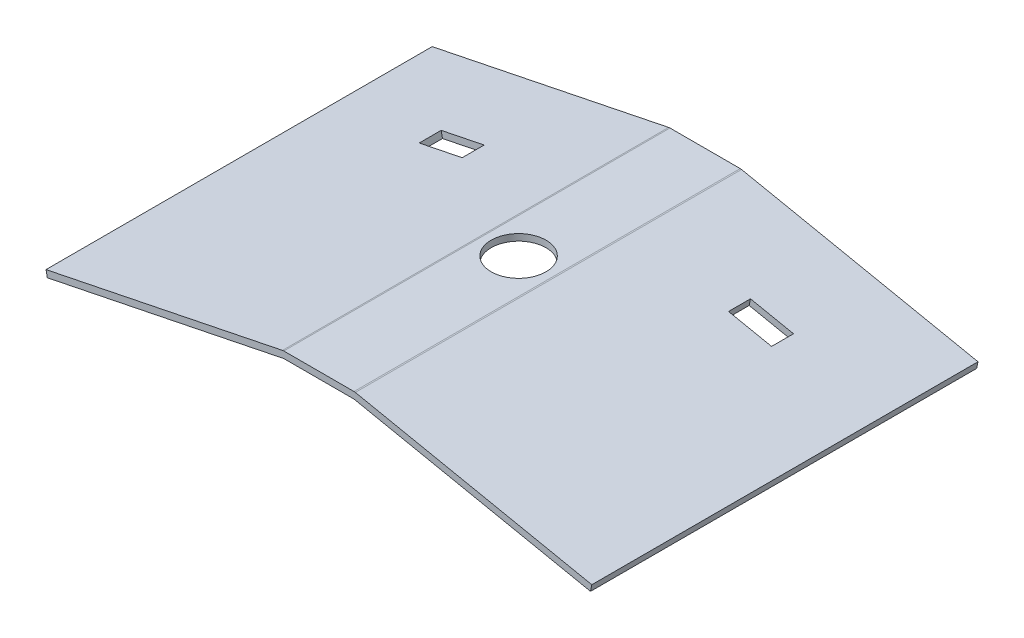
ISO-10303-21;
HEADER;
FILE_DESCRIPTION(('STEP AP214'),'2;1');
FILE_NAME('part.step','',(''),(''),'','','');
FILE_SCHEMA(('AUTOMOTIVE_DESIGN { 1 0 10303 214 1 1 1 1 }'));
ENDSEC;
DATA;
#1=APPLICATION_CONTEXT('core data for automotive mechanical design processes');
#2=APPLICATION_PROTOCOL_DEFINITION('international standard','automotive_design',2000,#1);
#3=PRODUCT_CONTEXT('',#1,'mechanical');
#4=PRODUCT('Part','Part','',(#3));
#5=PRODUCT_RELATED_PRODUCT_CATEGORY('part','',(#4));
#6=PRODUCT_DEFINITION_FORMATION('','',#4);
#7=PRODUCT_DEFINITION_CONTEXT('part definition',#1,'design');
#8=PRODUCT_DEFINITION('design','',#6,#7);
#9=PRODUCT_DEFINITION_SHAPE('','',#8);
#10=(LENGTH_UNIT() NAMED_UNIT(*) SI_UNIT(.MILLI.,.METRE.));
#11=(NAMED_UNIT(*) PLANE_ANGLE_UNIT() SI_UNIT($,.RADIAN.));
#12=(NAMED_UNIT(*) SI_UNIT($,.STERADIAN.) SOLID_ANGLE_UNIT());
#13=UNCERTAINTY_MEASURE_WITH_UNIT(LENGTH_MEASURE(1.E-05),#10,'distance_accuracy_value','');
#14=(GEOMETRIC_REPRESENTATION_CONTEXT(3) GLOBAL_UNCERTAINTY_ASSIGNED_CONTEXT((#13)) GLOBAL_UNIT_ASSIGNED_CONTEXT((#10,
#11,#12)) REPRESENTATION_CONTEXT('',''));
#15=CARTESIAN_POINT('',(0.,0.,0.));
#16=DIRECTION('',(0.,0.,1.));
#17=DIRECTION('',(1.,0.,0.));
#18=AXIS2_PLACEMENT_3D('',#15,#16,#17);
#19=CARTESIAN_POINT('',(4.55909920019514,22.335152700819,-85.));
#20=DIRECTION('',(0.199998115287844,0.979796281826641,0.));
#21=DIRECTION('',(-0.979796281826641,0.199998115287844,0.));
#22=AXIS2_PLACEMENT_3D('',#19,#20,#21);
#23=PLANE('',#22);
#24=DIRECTION('',(0.979796281826641,-0.199998115287844,0.));
#25=VECTOR('',#24,1.);
#26=CARTESIAN_POINT('',(4.55909920019514,22.335152700819,-35.));
#27=LINE('',#26,#25);
#28=CARTESIAN_POINT('',(60.0908326821988,10.9998963408314,-35.));
#29=VERTEX_POINT('',#28);
#30=CARTESIAN_POINT('',(79.6867583187317,6.99993403507454,-35.));
#31=VERTEX_POINT('',#30);
#32=EDGE_CURVE('E197',#29,#31,#27,.T.);
#33=ORIENTED_EDGE('',*,*,#32,.T.);
#34=DIRECTION('',(0.,0.,-1.));
#35=VECTOR('',#34,1.);
#36=CARTESIAN_POINT('',(79.6867583187317,6.99993403507455,-85.));
#37=LINE('',#36,#35);
#38=CARTESIAN_POINT('',(79.6867583187317,6.99993403507454,-45.));
#39=VERTEX_POINT('',#38);
#40=EDGE_CURVE('E200',#31,#39,#37,.T.);
#41=ORIENTED_EDGE('',*,*,#40,.T.);
#42=DIRECTION('',(-0.979796281826641,0.199998115287844,0.));
#43=VECTOR('',#42,1.);
#44=CARTESIAN_POINT('',(4.55909920019514,22.335152700819,-45.));
#45=LINE('',#44,#43);
#46=CARTESIAN_POINT('',(60.0908326821988,10.9998963408314,-45.));
#47=VERTEX_POINT('',#46);
#48=EDGE_CURVE('E192',#39,#47,#45,.T.);
#49=ORIENTED_EDGE('',*,*,#48,.T.);
#50=DIRECTION('',(0.,0.,1.));
#51=VECTOR('',#50,1.);
#52=CARTESIAN_POINT('',(60.0908326821988,10.9998963408314,-85.));
#53=LINE('',#52,#51);
#54=EDGE_CURVE('E172',#47,#29,#53,.T.);
#55=ORIENTED_EDGE('',*,*,#54,.T.);
#56=EDGE_LOOP('',(#33,#41,#49,#55));
#57=FACE_BOUND('',#56,.T.);
#58=DIRECTION('',(0.,0.,1.));
#59=VECTOR('',#58,1.);
#60=CARTESIAN_POINT('',(16.,19.9998115287844,-85.));
#61=LINE('',#60,#59);
#62=CARTESIAN_POINT('',(16.,19.9998115287844,-85.));
#63=VERTEX_POINT('',#62);
#64=CARTESIAN_POINT('',(16.,19.9998115287844,91.));
#65=VERTEX_POINT('',#64);
#66=EDGE_CURVE('E298',#63,#65,#61,.T.);
#67=ORIENTED_EDGE('',*,*,#66,.F.);
#68=DIRECTION('',(-0.979796281826641,0.199998115287844,0.));
#69=VECTOR('',#68,1.);
#70=CARTESIAN_POINT('',(4.55909920019514,22.335152700819,-85.));
#71=LINE('',#70,#69);
#72=CARTESIAN_POINT('',(123.77759100093,-1.99998115287843,-85.));
#73=VERTEX_POINT('',#72);
#74=EDGE_CURVE('E286',#73,#63,#71,.T.);
#75=ORIENTED_EDGE('',*,*,#74,.F.);
#76=DIRECTION('',(0.,0.,1.));
#77=VECTOR('',#76,1.);
#78=CARTESIAN_POINT('',(123.77759100093,-1.99998115287843,-85.));
#79=LINE('',#78,#77);
#80=CARTESIAN_POINT('',(123.77759100093,-1.99998115287843,91.));
#81=VERTEX_POINT('',#80);
#82=EDGE_CURVE('E296',#73,#81,#79,.T.);
#83=ORIENTED_EDGE('',*,*,#82,.T.);
#84=DIRECTION('',(-0.979796281826641,0.199998115287844,0.));
#85=VECTOR('',#84,1.);
#86=CARTESIAN_POINT('',(4.55909920019514,22.335152700819,91.));
#87=LINE('',#86,#85);
#88=EDGE_CURVE('E262',#81,#65,#87,.T.);
#89=ORIENTED_EDGE('',*,*,#88,.T.);
#90=EDGE_LOOP('',(#67,#75,#83,#89));
#91=FACE_BOUND('',#90,.T.);
#92=ADVANCED_FACE('F40',(#57,#91),#23,.F.);
#93=CARTESIAN_POINT('',(0.,19.9998115287844,-85.));
#94=DIRECTION('',(0.,1.,0.));
#95=DIRECTION('',(-1.,0.,0.));
#96=AXIS2_PLACEMENT_3D('',#93,#94,#95);
#97=PLANE('',#96);
#98=CARTESIAN_POINT('',(0.,19.9998115287844,0.));
#99=DIRECTION('',(0.,1.,0.));
#100=DIRECTION('',(-1.,0.,0.));
#101=AXIS2_PLACEMENT_3D('',#98,#99,#100);
#102=CIRCLE('',#101,12.5);
#103=CARTESIAN_POINT('',(-12.5,19.9998115287844,0.));
#104=VERTEX_POINT('',#103);
#105=EDGE_CURVE('E238',#104,#104,#102,.T.);
#106=ORIENTED_EDGE('',*,*,#105,.T.);
#107=EDGE_LOOP('',(#106));
#108=FACE_BOUND('',#107,.T.);
#109=DIRECTION('',(0.,0.,1.));
#110=VECTOR('',#109,1.);
#111=CARTESIAN_POINT('',(-16.,19.9998115287844,-85.));
#112=LINE('',#111,#110);
#113=CARTESIAN_POINT('',(-16.,19.9998115287844,-85.));
#114=VERTEX_POINT('',#113);
#115=CARTESIAN_POINT('',(-16.,19.9998115287844,91.));
#116=VERTEX_POINT('',#115);
#117=EDGE_CURVE('E300',#114,#116,#112,.T.);
#118=ORIENTED_EDGE('',*,*,#117,.F.);
#119=DIRECTION('',(-1.,0.,0.));
#120=VECTOR('',#119,1.);
#121=CARTESIAN_POINT('',(0.,19.9998115287844,-85.));
#122=LINE('',#121,#120);
#123=EDGE_CURVE('E283',#63,#114,#122,.T.);
#124=ORIENTED_EDGE('',*,*,#123,.F.);
#125=ORIENTED_EDGE('',*,*,#66,.T.);
#126=DIRECTION('',(-1.,0.,0.));
#127=VECTOR('',#126,1.);
#128=CARTESIAN_POINT('',(0.,19.9998115287844,91.));
#129=LINE('',#128,#127);
#130=EDGE_CURVE('E259',#65,#116,#129,.T.);
#131=ORIENTED_EDGE('',*,*,#130,.T.);
#132=EDGE_LOOP('',(#118,#124,#125,#131));
#133=FACE_BOUND('',#132,.T.);
#134=ADVANCED_FACE('F337',(#108,#133),#97,.F.);
#135=CARTESIAN_POINT('',(-4.55909920019512,22.335152700819,-85.));
#136=DIRECTION('',(-0.199998115287844,0.979796281826641,0.));
#137=DIRECTION('',(-0.979796281826641,-0.199998115287844,0.));
#138=AXIS2_PLACEMENT_3D('',#135,#136,#137);
#139=PLANE('',#138);
#140=DIRECTION('',(-0.979796281826641,-0.199998115287844,0.));
#141=VECTOR('',#140,1.);
#142=CARTESIAN_POINT('',(-4.55909920019512,22.335152700819,-45.));
#143=LINE('',#142,#141);
#144=CARTESIAN_POINT('',(-60.0908326821988,10.9998963408314,-45.));
#145=VERTEX_POINT('',#144);
#146=CARTESIAN_POINT('',(-79.6867583187317,6.99993403507452,-45.));
#147=VERTEX_POINT('',#146);
#148=EDGE_CURVE('E229',#145,#147,#143,.T.);
#149=ORIENTED_EDGE('',*,*,#148,.T.);
#150=DIRECTION('',(0.,0.,1.));
#151=VECTOR('',#150,1.);
#152=CARTESIAN_POINT('',(-79.6867583187317,6.99993403507453,-85.));
#153=LINE('',#152,#151);
#154=CARTESIAN_POINT('',(-79.6867583187317,6.99993403507452,-35.));
#155=VERTEX_POINT('',#154);
#156=EDGE_CURVE('E232',#147,#155,#153,.T.);
#157=ORIENTED_EDGE('',*,*,#156,.T.);
#158=DIRECTION('',(0.979796281826641,0.199998115287844,0.));
#159=VECTOR('',#158,1.);
#160=CARTESIAN_POINT('',(-4.55909920019514,22.335152700819,-35.));
#161=LINE('',#160,#159);
#162=CARTESIAN_POINT('',(-60.0908326821989,10.9998963408314,-35.));
#163=VERTEX_POINT('',#162);
#164=EDGE_CURVE('E217',#155,#163,#161,.T.);
#165=ORIENTED_EDGE('',*,*,#164,.T.);
#166=DIRECTION('',(0.,0.,-1.));
#167=VECTOR('',#166,1.);
#168=CARTESIAN_POINT('',(-60.0908326821988,10.9998963408314,-85.));
#169=LINE('',#168,#167);
#170=EDGE_CURVE('E226',#163,#145,#169,.T.);
#171=ORIENTED_EDGE('',*,*,#170,.T.);
#172=EDGE_LOOP('',(#149,#157,#165,#171));
#173=FACE_BOUND('',#172,.T.);
#174=DIRECTION('',(-0.979796281826641,-0.199998115287844,0.));
#175=VECTOR('',#174,1.);
#176=CARTESIAN_POINT('',(-4.55909920019512,22.335152700819,-85.));
#177=LINE('',#176,#175);
#178=CARTESIAN_POINT('',(-123.77759100093,-1.99998115287844,-85.));
#179=VERTEX_POINT('',#178);
#180=EDGE_CURVE('E281',#114,#179,#177,.T.);
#181=ORIENTED_EDGE('',*,*,#180,.F.);
#182=ORIENTED_EDGE('',*,*,#117,.T.);
#183=DIRECTION('',(-0.979796281826641,-0.199998115287844,0.));
#184=VECTOR('',#183,1.);
#185=CARTESIAN_POINT('',(-4.55909920019512,22.335152700819,91.));
#186=LINE('',#185,#184);
#187=CARTESIAN_POINT('',(-123.77759100093,-1.99998115287844,91.));
#188=VERTEX_POINT('',#187);
#189=EDGE_CURVE('E256',#116,#188,#186,.T.);
#190=ORIENTED_EDGE('',*,*,#189,.T.);
#191=DIRECTION('',(0.,0.,1.));
#192=VECTOR('',#191,1.);
#193=CARTESIAN_POINT('',(-123.77759100093,-1.99998115287844,-85.));
#194=LINE('',#193,#192);
#195=EDGE_CURVE('E302',#179,#188,#194,.T.);
#196=ORIENTED_EDGE('',*,*,#195,.F.);
#197=EDGE_LOOP('',(#181,#182,#190,#196));
#198=FACE_BOUND('',#197,.T.);
#199=ADVANCED_FACE('F343',(#173,#198),#139,.F.);
#200=CARTESIAN_POINT('',(2.46158922425188,24.3674555960026,-85.));
#201=DIRECTION('',(-0.100508005087505,-0.994936249672978,0.));
#202=DIRECTION('',(0.994936249672978,-0.100508005087505,0.));
#203=AXIS2_PLACEMENT_3D('',#200,#201,#202);
#204=PLANE('',#203);
#205=DIRECTION('',(0.,0.,1.));
#206=VECTOR('',#205,1.);
#207=CARTESIAN_POINT('',(16.,22.9998115287844,-85.));
#208=LINE('',#207,#206);
#209=CARTESIAN_POINT('',(16.,22.9998115287844,-85.));
#210=VERTEX_POINT('',#209);
#211=CARTESIAN_POINT('',(16.,22.9998115287844,91.));
#212=VERTEX_POINT('',#211);
#213=EDGE_CURVE('E44',#210,#212,#208,.T.);
#214=ORIENTED_EDGE('',*,*,#213,.T.);
#215=DIRECTION('',(0.994936249672978,-0.100508005087505,0.));
#216=VECTOR('',#215,1.);
#217=CARTESIAN_POINT('',(2.46158922425188,24.3674555960026,91.));
#218=LINE('',#217,#216);
#219=CARTESIAN_POINT('',(16.5999943458635,22.9392003742643,91.));
#220=VERTEX_POINT('',#219);
#221=EDGE_CURVE('E241',#212,#220,#218,.T.);
#222=ORIENTED_EDGE('',*,*,#221,.T.);
#223=DIRECTION('',(0.,0.,1.));
#224=VECTOR('',#223,1.);
#225=CARTESIAN_POINT('',(16.5999943458635,22.9392003742643,-85.));
#226=LINE('',#225,#224);
#227=CARTESIAN_POINT('',(16.5999943458635,22.9392003742643,-85.));
#228=VERTEX_POINT('',#227);
#229=EDGE_CURVE('E11',#228,#220,#226,.T.);
#230=ORIENTED_EDGE('',*,*,#229,.F.);
#231=DIRECTION('',(0.994936249672978,-0.100508005087505,0.));
#232=VECTOR('',#231,1.);
#233=CARTESIAN_POINT('',(2.46158922425188,24.3674555960026,-85.));
#234=LINE('',#233,#232);
#235=EDGE_CURVE('E271',#210,#228,#234,.T.);
#236=ORIENTED_EDGE('',*,*,#235,.F.);
#237=EDGE_LOOP('',(#214,#222,#230,#236));
#238=FACE_BOUND('',#237,.T.);
#239=ADVANCED_FACE('F42',(#238),#204,.F.);
#240=CARTESIAN_POINT('',(5.15909354605866,25.2745415462989,-85.));
#241=DIRECTION('',(0.199998115287844,0.979796281826641,0.));
#242=DIRECTION('',(-0.979796281826641,0.199998115287844,0.));
#243=AXIS2_PLACEMENT_3D('',#240,#241,#242);
#244=PLANE('',#243);
#245=DIRECTION('',(0.,0.,-1.));
#246=VECTOR('',#245,1.);
#247=CARTESIAN_POINT('',(80.2867526645952,9.93932288055448,-45.));
#248=LINE('',#247,#246);
#249=CARTESIAN_POINT('',(80.2867526645952,9.93932288055448,-35.));
#250=VERTEX_POINT('',#249);
#251=CARTESIAN_POINT('',(80.2867526645952,9.93932288055447,-45.));
#252=VERTEX_POINT('',#251);
#253=EDGE_CURVE('E65',#250,#252,#248,.T.);
#254=ORIENTED_EDGE('',*,*,#253,.F.);
#255=DIRECTION('',(0.979796281826641,-0.199998115287844,0.));
#256=VECTOR('',#255,1.);
#257=CARTESIAN_POINT('',(80.2867526645952,9.93932288055448,-35.));
#258=LINE('',#257,#256);
#259=CARTESIAN_POINT('',(60.6908270280624,13.9392851863114,-35.));
#260=VERTEX_POINT('',#259);
#261=EDGE_CURVE('E185',#260,#250,#258,.T.);
#262=ORIENTED_EDGE('',*,*,#261,.F.);
#263=DIRECTION('',(0.,0.,1.));
#264=VECTOR('',#263,1.);
#265=CARTESIAN_POINT('',(60.6908270280624,13.9392851863114,-45.));
#266=LINE('',#265,#264);
#267=CARTESIAN_POINT('',(60.6908270280624,13.9392851863114,-45.));
#268=VERTEX_POINT('',#267);
#269=EDGE_CURVE('E169',#268,#260,#266,.T.);
#270=ORIENTED_EDGE('',*,*,#269,.F.);
#271=DIRECTION('',(-0.979796281826641,0.199998115287844,0.));
#272=VECTOR('',#271,1.);
#273=CARTESIAN_POINT('',(80.2867526645952,9.93932288055448,-45.));
#274=LINE('',#273,#272);
#275=EDGE_CURVE('E178',#252,#268,#274,.T.);
#276=ORIENTED_EDGE('',*,*,#275,.F.);
#277=EDGE_LOOP('',(#254,#262,#270,#276));
#278=FACE_BOUND('',#277,.T.);
#279=ORIENTED_EDGE('',*,*,#229,.T.);
#280=DIRECTION('',(-0.979796281826641,0.199998115287844,0.));
#281=VECTOR('',#280,1.);
#282=CARTESIAN_POINT('',(5.15909354605866,25.2745415462989,91.));
#283=LINE('',#282,#281);
#284=CARTESIAN_POINT('',(124.377585346794,0.939407692601486,91.));
#285=VERTEX_POINT('',#284);
#286=EDGE_CURVE('E268',#285,#220,#283,.T.);
#287=ORIENTED_EDGE('',*,*,#286,.F.);
#288=DIRECTION('',(0.,0.,1.));
#289=VECTOR('',#288,1.);
#290=CARTESIAN_POINT('',(124.377585346794,0.939407692601486,-85.));
#291=LINE('',#290,#289);
#292=CARTESIAN_POINT('',(124.377585346794,0.939407692601486,-85.));
#293=VERTEX_POINT('',#292);
#294=EDGE_CURVE('E49',#293,#285,#291,.T.);
#295=ORIENTED_EDGE('',*,*,#294,.F.);
#296=DIRECTION('',(-0.979796281826641,0.199998115287844,0.));
#297=VECTOR('',#296,1.);
#298=CARTESIAN_POINT('',(5.15909354605866,25.2745415462989,-85.));
#299=LINE('',#298,#297);
#300=EDGE_CURVE('E292',#293,#228,#299,.T.);
#301=ORIENTED_EDGE('',*,*,#300,.T.);
#302=EDGE_LOOP('',(#279,#287,#295,#301));
#303=FACE_BOUND('',#302,.T.);
#304=ADVANCED_FACE('F182',(#278,#303),#244,.T.);
#305=CARTESIAN_POINT('',(119.218491800735,-24.3351338536982,-85.));
#306=DIRECTION('',(0.97979628182664,-0.19999811528785,0.));
#307=DIRECTION('',(0.19999811528785,0.97979628182664,0.));
#308=AXIS2_PLACEMENT_3D('',#305,#306,#307);
#309=PLANE('',#308);
#310=ORIENTED_EDGE('',*,*,#294,.T.);
#311=DIRECTION('',(0.19999811528785,0.97979628182664,0.));
#312=VECTOR('',#311,1.);
#313=CARTESIAN_POINT('',(119.218491800735,-24.3351338536982,91.));
#314=LINE('',#313,#312);
#315=EDGE_CURVE('E265',#81,#285,#314,.T.);
#316=ORIENTED_EDGE('',*,*,#315,.F.);
#317=ORIENTED_EDGE('',*,*,#82,.F.);
#318=DIRECTION('',(0.19999811528785,0.97979628182664,0.));
#319=VECTOR('',#318,1.);
#320=CARTESIAN_POINT('',(119.218491800735,-24.3351338536982,-85.));
#321=LINE('',#320,#319);
#322=EDGE_CURVE('E289',#73,#293,#321,.T.);
#323=ORIENTED_EDGE('',*,*,#322,.T.);
#324=EDGE_LOOP('',(#310,#316,#317,#323));
#325=FACE_BOUND('',#324,.T.);
#326=ADVANCED_FACE('F348',(#325),#309,.T.);
#327=CARTESIAN_POINT('',(-119.218491800735,-24.3351338536977,-85.));
#328=DIRECTION('',(0.97979628182664,0.199998115287846,0.));
#329=DIRECTION('',(-0.199998115287846,0.979796281826641,0.));
#330=AXIS2_PLACEMENT_3D('',#327,#328,#329);
#331=PLANE('',#330);
#332=ORIENTED_EDGE('',*,*,#195,.T.);
#333=DIRECTION('',(-0.199998115287846,0.97979628182664,0.));
#334=VECTOR('',#333,1.);
#335=CARTESIAN_POINT('',(-119.218491800735,-24.3351338536977,91.));
#336=LINE('',#335,#334);
#337=CARTESIAN_POINT('',(-124.377585346794,0.939407692601479,91.));
#338=VERTEX_POINT('',#337);
#339=EDGE_CURVE('E253',#188,#338,#336,.T.);
#340=ORIENTED_EDGE('',*,*,#339,.T.);
#341=DIRECTION('',(0.,0.,1.));
#342=VECTOR('',#341,1.);
#343=CARTESIAN_POINT('',(-124.377585346794,0.939407692601479,-85.));
#344=LINE('',#343,#342);
#345=CARTESIAN_POINT('',(-124.377585346794,0.939407692601479,-85.));
#346=VERTEX_POINT('',#345);
#347=EDGE_CURVE('E304',#346,#338,#344,.T.);
#348=ORIENTED_EDGE('',*,*,#347,.F.);
#349=DIRECTION('',(-0.199998115287846,0.97979628182664,0.));
#350=VECTOR('',#349,1.);
#351=CARTESIAN_POINT('',(-119.218491800735,-24.3351338536977,-85.));
#352=LINE('',#351,#350);
#353=EDGE_CURVE('E279',#179,#346,#352,.T.);
#354=ORIENTED_EDGE('',*,*,#353,.F.);
#355=EDGE_LOOP('',(#332,#340,#348,#354));
#356=FACE_BOUND('',#355,.T.);
#357=ADVANCED_FACE('F354',(#356),#331,.F.);
#358=CARTESIAN_POINT('',(-5.15909354605865,25.2745415462989,-85.));
#359=DIRECTION('',(0.199998115287844,-0.979796281826641,0.));
#360=DIRECTION('',(0.979796281826641,0.199998115287844,0.));
#361=AXIS2_PLACEMENT_3D('',#358,#359,#360);
#362=PLANE('',#361);
#363=DIRECTION('',(0.979796281826641,0.199998115287844,0.));
#364=VECTOR('',#363,1.);
#365=CARTESIAN_POINT('',(-80.2867526645952,9.93932288055446,-35.));
#366=LINE('',#365,#364);
#367=CARTESIAN_POINT('',(-80.2867526645952,9.93932288055445,-35.));
#368=VERTEX_POINT('',#367);
#369=CARTESIAN_POINT('',(-60.6908270280624,13.9392851863113,-35.));
#370=VERTEX_POINT('',#369);
#371=EDGE_CURVE('E205',#368,#370,#366,.T.);
#372=ORIENTED_EDGE('',*,*,#371,.F.);
#373=DIRECTION('',(0.,0.,1.));
#374=VECTOR('',#373,1.);
#375=CARTESIAN_POINT('',(-80.2867526645952,9.93932288055446,-45.));
#376=LINE('',#375,#374);
#377=CARTESIAN_POINT('',(-80.2867526645952,9.93932288055446,-45.));
#378=VERTEX_POINT('',#377);
#379=EDGE_CURVE('E203',#378,#368,#376,.T.);
#380=ORIENTED_EDGE('',*,*,#379,.F.);
#381=DIRECTION('',(-0.979796281826641,-0.199998115287844,0.));
#382=VECTOR('',#381,1.);
#383=CARTESIAN_POINT('',(-80.2867526645952,9.93932288055446,-45.));
#384=LINE('',#383,#382);
#385=CARTESIAN_POINT('',(-60.6908270280624,13.9392851863113,-45.));
#386=VERTEX_POINT('',#385);
#387=EDGE_CURVE('E211',#386,#378,#384,.T.);
#388=ORIENTED_EDGE('',*,*,#387,.F.);
#389=DIRECTION('',(0.,0.,-1.));
#390=VECTOR('',#389,1.);
#391=CARTESIAN_POINT('',(-60.6908270280624,13.9392851863113,-45.));
#392=LINE('',#391,#390);
#393=EDGE_CURVE('E208',#370,#386,#392,.T.);
#394=ORIENTED_EDGE('',*,*,#393,.F.);
#395=EDGE_LOOP('',(#372,#380,#388,#394));
#396=FACE_BOUND('',#395,.T.);
#397=ORIENTED_EDGE('',*,*,#347,.T.);
#398=DIRECTION('',(0.979796281826641,0.199998115287844,0.));
#399=VECTOR('',#398,1.);
#400=CARTESIAN_POINT('',(-5.15909354605865,25.2745415462989,91.));
#401=LINE('',#400,#399);
#402=CARTESIAN_POINT('',(-16.5999943458635,22.9392003742643,91.));
#403=VERTEX_POINT('',#402);
#404=EDGE_CURVE('E250',#338,#403,#401,.T.);
#405=ORIENTED_EDGE('',*,*,#404,.T.);
#406=DIRECTION('',(0.,0.,1.));
#407=VECTOR('',#406,1.);
#408=CARTESIAN_POINT('',(-16.5999943458635,22.9392003742643,-85.));
#409=LINE('',#408,#407);
#410=CARTESIAN_POINT('',(-16.5999943458635,22.9392003742643,-85.));
#411=VERTEX_POINT('',#410);
#412=EDGE_CURVE('E306',#411,#403,#409,.T.);
#413=ORIENTED_EDGE('',*,*,#412,.F.);
#414=DIRECTION('',(0.979796281826641,0.199998115287844,0.));
#415=VECTOR('',#414,1.);
#416=CARTESIAN_POINT('',(-5.15909354605865,25.2745415462989,-85.));
#417=LINE('',#416,#415);
#418=EDGE_CURVE('E277',#346,#411,#417,.T.);
#419=ORIENTED_EDGE('',*,*,#418,.F.);
#420=EDGE_LOOP('',(#397,#405,#413,#419));
#421=FACE_BOUND('',#420,.T.);
#422=ADVANCED_FACE('F332',(#396,#421),#362,.F.);
#423=CARTESIAN_POINT('',(-2.4615892242535,24.3674555960033,-85.));
#424=DIRECTION('',(0.100508005087568,-0.994936249672972,0.));
#425=DIRECTION('',(0.994936249672972,0.100508005087568,0.));
#426=AXIS2_PLACEMENT_3D('',#423,#424,#425);
#427=PLANE('',#426);
#428=ORIENTED_EDGE('',*,*,#412,.T.);
#429=DIRECTION('',(0.994936249672972,0.100508005087568,0.));
#430=VECTOR('',#429,1.);
#431=CARTESIAN_POINT('',(-2.4615892242535,24.3674555960033,91.));
#432=LINE('',#431,#430);
#433=CARTESIAN_POINT('',(-16.,22.9998115287844,91.));
#434=VERTEX_POINT('',#433);
#435=EDGE_CURVE('E247',#403,#434,#432,.T.);
#436=ORIENTED_EDGE('',*,*,#435,.T.);
#437=DIRECTION('',(0.,0.,1.));
#438=VECTOR('',#437,1.);
#439=CARTESIAN_POINT('',(-16.,22.9998115287844,-85.));
#440=LINE('',#439,#438);
#441=CARTESIAN_POINT('',(-16.,22.9998115287844,-85.));
#442=VERTEX_POINT('',#441);
#443=EDGE_CURVE('E307',#442,#434,#440,.T.);
#444=ORIENTED_EDGE('',*,*,#443,.F.);
#445=DIRECTION('',(0.994936249672972,0.100508005087568,0.));
#446=VECTOR('',#445,1.);
#447=CARTESIAN_POINT('',(-2.4615892242535,24.3674555960033,-85.));
#448=LINE('',#447,#446);
#449=EDGE_CURVE('E275',#411,#442,#448,.T.);
#450=ORIENTED_EDGE('',*,*,#449,.F.);
#451=EDGE_LOOP('',(#428,#436,#444,#450));
#452=FACE_BOUND('',#451,.T.);
#453=ADVANCED_FACE('F324',(#452),#427,.F.);
#454=CARTESIAN_POINT('',(0.,22.9998115287844,-85.));
#455=DIRECTION('',(0.,-1.,0.));
#456=DIRECTION('',(0.,0.,-1.));
#457=AXIS2_PLACEMENT_3D('',#454,#455,#456);
#458=PLANE('',#457);
#459=CARTESIAN_POINT('',(0.,22.9998115287844,0.));
#460=DIRECTION('',(0.,1.,0.));
#461=DIRECTION('',(0.,0.,1.));
#462=AXIS2_PLACEMENT_3D('',#459,#460,#461);
#463=CIRCLE('',#462,12.5);
#464=CARTESIAN_POINT('',(0.,22.9998115287844,12.5));
#465=VERTEX_POINT('',#464);
#466=EDGE_CURVE('E235',#465,#465,#463,.T.);
#467=ORIENTED_EDGE('',*,*,#466,.F.);
#468=EDGE_LOOP('',(#467));
#469=FACE_BOUND('',#468,.T.);
#470=ORIENTED_EDGE('',*,*,#443,.T.);
#471=DIRECTION('',(1.,0.,0.));
#472=VECTOR('',#471,1.);
#473=CARTESIAN_POINT('',(0.,22.9998115287844,91.));
#474=LINE('',#473,#472);
#475=EDGE_CURVE('E244',#434,#212,#474,.T.);
#476=ORIENTED_EDGE('',*,*,#475,.T.);
#477=ORIENTED_EDGE('',*,*,#213,.F.);
#478=DIRECTION('',(1.,0.,0.));
#479=VECTOR('',#478,1.);
#480=CARTESIAN_POINT('',(0.,22.9998115287844,-85.));
#481=LINE('',#480,#479);
#482=EDGE_CURVE('E273',#442,#210,#481,.T.);
#483=ORIENTED_EDGE('',*,*,#482,.F.);
#484=EDGE_LOOP('',(#470,#476,#477,#483));
#485=FACE_BOUND('',#484,.T.);
#486=ADVANCED_FACE('F321',(#469,#485),#458,.F.);
#487=CARTESIAN_POINT('',(0.,0.,-85.));
#488=DIRECTION('',(0.,0.,1.));
#489=DIRECTION('',(1.,0.,0.));
#490=AXIS2_PLACEMENT_3D('',#487,#488,#489);
#491=PLANE('',#490);
#492=ORIENTED_EDGE('',*,*,#235,.T.);
#493=ORIENTED_EDGE('',*,*,#300,.F.);
#494=ORIENTED_EDGE('',*,*,#322,.F.);
#495=ORIENTED_EDGE('',*,*,#74,.T.);
#496=ORIENTED_EDGE('',*,*,#123,.T.);
#497=ORIENTED_EDGE('',*,*,#180,.T.);
#498=ORIENTED_EDGE('',*,*,#353,.T.);
#499=ORIENTED_EDGE('',*,*,#418,.T.);
#500=ORIENTED_EDGE('',*,*,#449,.T.);
#501=ORIENTED_EDGE('',*,*,#482,.T.);
#502=EDGE_LOOP('',(#492,#493,#494,#495,#496,#497,#498,#499,#500,#501));
#503=FACE_BOUND('',#502,.T.);
#504=ADVANCED_FACE('F323',(#503),#491,.F.);
#505=CARTESIAN_POINT('',(0.,0.,91.));
#506=DIRECTION('',(0.,0.,1.));
#507=DIRECTION('',(1.,0.,0.));
#508=AXIS2_PLACEMENT_3D('',#505,#506,#507);
#509=PLANE('',#508);
#510=ORIENTED_EDGE('',*,*,#221,.F.);
#511=ORIENTED_EDGE('',*,*,#475,.F.);
#512=ORIENTED_EDGE('',*,*,#435,.F.);
#513=ORIENTED_EDGE('',*,*,#404,.F.);
#514=ORIENTED_EDGE('',*,*,#339,.F.);
#515=ORIENTED_EDGE('',*,*,#189,.F.);
#516=ORIENTED_EDGE('',*,*,#130,.F.);
#517=ORIENTED_EDGE('',*,*,#88,.F.);
#518=ORIENTED_EDGE('',*,*,#315,.T.);
#519=ORIENTED_EDGE('',*,*,#286,.T.);
#520=EDGE_LOOP('',(#510,#511,#512,#513,#514,#515,#516,#517,#518,#519));
#521=FACE_BOUND('',#520,.T.);
#522=ADVANCED_FACE('F318',(#521),#509,.T.);
#523=CARTESIAN_POINT('',(0.,-1.99998115287844,0.));
#524=DIRECTION('',(0.,1.,0.));
#525=DIRECTION('',(0.,0.,1.));
#526=AXIS2_PLACEMENT_3D('',#523,#524,#525);
#527=CYLINDRICAL_SURFACE('',#526,12.5);
#528=ORIENTED_EDGE('',*,*,#466,.T.);
#529=EDGE_LOOP('',(#528));
#530=FACE_BOUND('',#529,.T.);
#531=ORIENTED_EDGE('',*,*,#105,.F.);
#532=EDGE_LOOP('',(#531));
#533=FACE_BOUND('',#532,.T.);
#534=ADVANCED_FACE('F393',(#530,#533),#527,.F.);
#535=CARTESIAN_POINT('',(-69.7607383443722,-41.6279115334557,-45.));
#536=DIRECTION('',(-0.979796281826641,-0.199998115287844,0.));
#537=DIRECTION('',(0.199998115287844,-0.979796281826641,0.));
#538=AXIS2_PLACEMENT_3D('',#535,#536,#537);
#539=PLANE('',#538);
#540=DIRECTION('',(-0.199998115287844,0.979796281826641,0.));
#541=VECTOR('',#540,1.);
#542=CARTESIAN_POINT('',(-69.7607383443722,-41.6279115334557,-45.));
#543=LINE('',#542,#541);
#544=EDGE_CURVE('E215',#147,#378,#543,.T.);
#545=ORIENTED_EDGE('',*,*,#544,.T.);
#546=ORIENTED_EDGE('',*,*,#379,.T.);
#547=DIRECTION('',(-0.199998115287844,0.979796281826641,0.));
#548=VECTOR('',#547,1.);
#549=CARTESIAN_POINT('',(-69.7607383443722,-41.6279115334557,-35.));
#550=LINE('',#549,#548);
#551=EDGE_CURVE('E214',#155,#368,#550,.T.);
#552=ORIENTED_EDGE('',*,*,#551,.F.);
#553=ORIENTED_EDGE('',*,*,#156,.F.);
#554=EDGE_LOOP('',(#545,#546,#552,#553));
#555=FACE_BOUND('',#554,.T.);
#556=ADVANCED_FACE('F396',(#555),#539,.F.);
#557=CARTESIAN_POINT('',(-69.7607383443722,-41.6279115334557,-45.));
#558=DIRECTION('',(0.,0.,-1.));
#559=DIRECTION('',(-1.,0.,0.));
#560=AXIS2_PLACEMENT_3D('',#557,#558,#559);
#561=PLANE('',#560);
#562=DIRECTION('',(-0.199998115287844,0.979796281826641,0.));
#563=VECTOR('',#562,1.);
#564=CARTESIAN_POINT('',(-50.1648127078394,-37.6279492276988,-45.));
#565=LINE('',#564,#563);
#566=EDGE_CURVE('E218',#145,#386,#565,.T.);
#567=ORIENTED_EDGE('',*,*,#566,.T.);
#568=ORIENTED_EDGE('',*,*,#387,.T.);
#569=ORIENTED_EDGE('',*,*,#544,.F.);
#570=ORIENTED_EDGE('',*,*,#148,.F.);
#571=EDGE_LOOP('',(#567,#568,#569,#570));
#572=FACE_BOUND('',#571,.T.);
#573=ADVANCED_FACE('F400',(#572),#561,.F.);
#574=CARTESIAN_POINT('',(-50.1648127078394,-37.6279492276988,-45.));
#575=DIRECTION('',(0.979796281826641,0.199998115287844,0.));
#576=DIRECTION('',(-0.199998115287844,0.979796281826641,0.));
#577=AXIS2_PLACEMENT_3D('',#574,#575,#576);
#578=PLANE('',#577);
#579=DIRECTION('',(-0.199998115287844,0.979796281826641,0.));
#580=VECTOR('',#579,1.);
#581=CARTESIAN_POINT('',(-50.1648127078394,-37.6279492276988,-35.));
#582=LINE('',#581,#580);
#583=EDGE_CURVE('E220',#163,#370,#582,.T.);
#584=ORIENTED_EDGE('',*,*,#583,.T.);
#585=ORIENTED_EDGE('',*,*,#393,.T.);
#586=ORIENTED_EDGE('',*,*,#566,.F.);
#587=ORIENTED_EDGE('',*,*,#170,.F.);
#588=EDGE_LOOP('',(#584,#585,#586,#587));
#589=FACE_BOUND('',#588,.T.);
#590=ADVANCED_FACE('F406',(#589),#578,.F.);
#591=CARTESIAN_POINT('',(-69.7607383443722,-41.6279115334557,-35.));
#592=DIRECTION('',(0.,0.,1.));
#593=DIRECTION('',(1.,0.,0.));
#594=AXIS2_PLACEMENT_3D('',#591,#592,#593);
#595=PLANE('',#594);
#596=ORIENTED_EDGE('',*,*,#551,.T.);
#597=ORIENTED_EDGE('',*,*,#371,.T.);
#598=ORIENTED_EDGE('',*,*,#583,.F.);
#599=ORIENTED_EDGE('',*,*,#164,.F.);
#600=EDGE_LOOP('',(#596,#597,#598,#599));
#601=FACE_BOUND('',#600,.T.);
#602=ADVANCED_FACE('F402',(#601),#595,.F.);
#603=CARTESIAN_POINT('',(69.7607383443722,-41.6279115334558,-45.));
#604=DIRECTION('',(0.979796281826641,-0.199998115287844,0.));
#605=DIRECTION('',(0.199998115287844,0.979796281826641,0.));
#606=AXIS2_PLACEMENT_3D('',#603,#604,#605);
#607=PLANE('',#606);
#608=DIRECTION('',(0.199998115287844,0.979796281826641,0.));
#609=VECTOR('',#608,1.);
#610=CARTESIAN_POINT('',(69.7607383443722,-41.6279115334558,-35.));
#611=LINE('',#610,#609);
#612=EDGE_CURVE('E190',#31,#250,#611,.T.);
#613=ORIENTED_EDGE('',*,*,#612,.T.);
#614=ORIENTED_EDGE('',*,*,#253,.T.);
#615=DIRECTION('',(0.199998115287844,0.979796281826641,0.));
#616=VECTOR('',#615,1.);
#617=CARTESIAN_POINT('',(69.7607383443722,-41.6279115334558,-45.));
#618=LINE('',#617,#616);
#619=EDGE_CURVE('E175',#39,#252,#618,.T.);
#620=ORIENTED_EDGE('',*,*,#619,.F.);
#621=ORIENTED_EDGE('',*,*,#40,.F.);
#622=EDGE_LOOP('',(#613,#614,#620,#621));
#623=FACE_BOUND('',#622,.T.);
#624=ADVANCED_FACE('F405',(#623),#607,.F.);
#625=CARTESIAN_POINT('',(69.7607383443722,-41.6279115334558,-35.));
#626=DIRECTION('',(0.,0.,1.));
#627=DIRECTION('',(1.,0.,0.));
#628=AXIS2_PLACEMENT_3D('',#625,#626,#627);
#629=PLANE('',#628);
#630=DIRECTION('',(0.199998115287844,0.979796281826641,0.));
#631=VECTOR('',#630,1.);
#632=CARTESIAN_POINT('',(50.1648127078393,-37.6279492276989,-35.));
#633=LINE('',#632,#631);
#634=EDGE_CURVE('E174',#29,#260,#633,.T.);
#635=ORIENTED_EDGE('',*,*,#634,.T.);
#636=ORIENTED_EDGE('',*,*,#261,.T.);
#637=ORIENTED_EDGE('',*,*,#612,.F.);
#638=ORIENTED_EDGE('',*,*,#32,.F.);
#639=EDGE_LOOP('',(#635,#636,#637,#638));
#640=FACE_BOUND('',#639,.T.);
#641=ADVANCED_FACE('F416',(#640),#629,.F.);
#642=CARTESIAN_POINT('',(50.1648127078393,-37.6279492276989,-45.));
#643=DIRECTION('',(-0.979796281826641,0.199998115287844,0.));
#644=DIRECTION('',(-0.199998115287844,-0.979796281826641,0.));
#645=AXIS2_PLACEMENT_3D('',#642,#643,#644);
#646=PLANE('',#645);
#647=DIRECTION('',(0.199998115287844,0.979796281826641,0.));
#648=VECTOR('',#647,1.);
#649=CARTESIAN_POINT('',(50.1648127078393,-37.6279492276989,-45.));
#650=LINE('',#649,#648);
#651=EDGE_CURVE('E57',#47,#268,#650,.T.);
#652=ORIENTED_EDGE('',*,*,#651,.T.);
#653=ORIENTED_EDGE('',*,*,#269,.T.);
#654=ORIENTED_EDGE('',*,*,#634,.F.);
#655=ORIENTED_EDGE('',*,*,#54,.F.);
#656=EDGE_LOOP('',(#652,#653,#654,#655));
#657=FACE_BOUND('',#656,.T.);
#658=ADVANCED_FACE('F166',(#657),#646,.F.);
#659=CARTESIAN_POINT('',(69.7607383443722,-41.6279115334558,-45.));
#660=DIRECTION('',(0.,0.,-1.));
#661=DIRECTION('',(-1.,0.,0.));
#662=AXIS2_PLACEMENT_3D('',#659,#660,#661);
#663=PLANE('',#662);
#664=ORIENTED_EDGE('',*,*,#619,.T.);
#665=ORIENTED_EDGE('',*,*,#275,.T.);
#666=ORIENTED_EDGE('',*,*,#651,.F.);
#667=ORIENTED_EDGE('',*,*,#48,.F.);
#668=EDGE_LOOP('',(#664,#665,#666,#667));
#669=FACE_BOUND('',#668,.T.);
#670=ADVANCED_FACE('F179',(#669),#663,.F.);
#671=CLOSED_SHELL('',(#92,#134,#199,#239,#304,#326,#357,#422,#453,#486,#504,#522,#534,#556,#573,
#590,#602,#624,#641,#658,#670));
#672=MANIFOLD_SOLID_BREP('B2',#671);
#673=ADVANCED_BREP_SHAPE_REPRESENTATION('',(#18,#672),#14);
#674=SHAPE_DEFINITION_REPRESENTATION(#9,#673);
ENDSEC;
END-ISO-10303-21;
